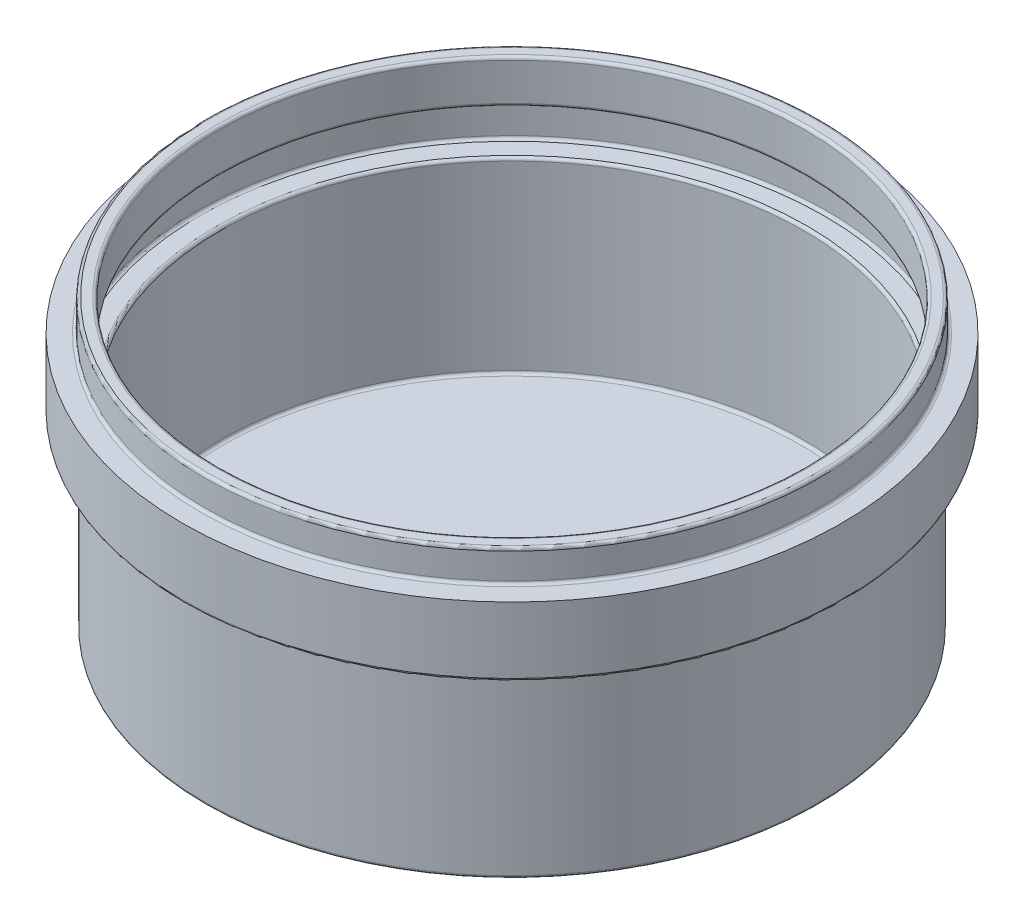
ISO-10303-21;
HEADER;
FILE_DESCRIPTION(('STEP AP214'),'2;1');
FILE_NAME('part.step','',(''),(''),'','','');
FILE_SCHEMA(('AUTOMOTIVE_DESIGN { 1 0 10303 214 1 1 1 1 }'));
ENDSEC;
DATA;
#1=APPLICATION_CONTEXT('core data for automotive mechanical design processes');
#2=APPLICATION_PROTOCOL_DEFINITION('international standard','automotive_design',2000,#1);
#3=PRODUCT_CONTEXT('',#1,'mechanical');
#4=PRODUCT('Part','Part','',(#3));
#5=PRODUCT_RELATED_PRODUCT_CATEGORY('part','',(#4));
#6=PRODUCT_DEFINITION_FORMATION('','',#4);
#7=PRODUCT_DEFINITION_CONTEXT('part definition',#1,'design');
#8=PRODUCT_DEFINITION('design','',#6,#7);
#9=PRODUCT_DEFINITION_SHAPE('','',#8);
#10=(LENGTH_UNIT() NAMED_UNIT(*) SI_UNIT(.MILLI.,.METRE.));
#11=(NAMED_UNIT(*) PLANE_ANGLE_UNIT() SI_UNIT($,.RADIAN.));
#12=(NAMED_UNIT(*) SI_UNIT($,.STERADIAN.) SOLID_ANGLE_UNIT());
#13=UNCERTAINTY_MEASURE_WITH_UNIT(LENGTH_MEASURE(1.E-05),#10,'distance_accuracy_value','');
#14=(GEOMETRIC_REPRESENTATION_CONTEXT(3) GLOBAL_UNCERTAINTY_ASSIGNED_CONTEXT((#13)) GLOBAL_UNIT_ASSIGNED_CONTEXT((#10,
#11,#12)) REPRESENTATION_CONTEXT('',''));
#15=CARTESIAN_POINT('',(0.,0.,0.));
#16=DIRECTION('',(0.,0.,1.));
#17=DIRECTION('',(1.,0.,0.));
#18=AXIS2_PLACEMENT_3D('',#15,#16,#17);
#19=CARTESIAN_POINT('',(0.,44.5,0.));
#20=DIRECTION('',(0.,-1.,0.));
#21=DIRECTION('',(0.,0.,-1.));
#22=AXIS2_PLACEMENT_3D('',#19,#20,#21);
#23=CYLINDRICAL_SURFACE('',#22,57.25);
#24=CARTESIAN_POINT('',(0.,33.,0.));
#25=DIRECTION('',(0.,1.,0.));
#26=DIRECTION('',(0.,0.,1.));
#27=AXIS2_PLACEMENT_3D('',#24,#25,#26);
#28=CIRCLE('',#27,57.25);
#29=CARTESIAN_POINT('',(0.,33.,57.25));
#30=VERTEX_POINT('',#29);
#31=EDGE_CURVE('E112',#30,#30,#28,.T.);
#32=ORIENTED_EDGE('',*,*,#31,.T.);
#33=EDGE_LOOP('',(#32));
#34=FACE_BOUND('',#33,.T.);
#35=CARTESIAN_POINT('',(0.,44.5,0.));
#36=DIRECTION('',(0.,1.,0.));
#37=DIRECTION('',(0.,0.,1.));
#38=AXIS2_PLACEMENT_3D('',#35,#36,#37);
#39=CIRCLE('',#38,57.25);
#40=CARTESIAN_POINT('',(0.,44.5,57.25));
#41=VERTEX_POINT('',#40);
#42=EDGE_CURVE('E115',#41,#41,#39,.T.);
#43=ORIENTED_EDGE('',*,*,#42,.F.);
#44=EDGE_LOOP('',(#43));
#45=FACE_BOUND('',#44,.T.);
#46=ADVANCED_FACE('F41',(#34,#45),#23,.T.);
#47=CARTESIAN_POINT('',(0.,44.5,0.));
#48=DIRECTION('',(0.,1.,0.));
#49=DIRECTION('',(0.,0.,1.));
#50=AXIS2_PLACEMENT_3D('',#47,#48,#49);
#51=PLANE('',#50);
#52=CARTESIAN_POINT('',(0.,44.5,0.));
#53=DIRECTION('',(0.,1.,0.));
#54=DIRECTION('',(0.,0.,1.));
#55=AXIS2_PLACEMENT_3D('',#52,#53,#54);
#56=CIRCLE('',#55,54.);
#57=CARTESIAN_POINT('',(0.,44.5,54.));
#58=VERTEX_POINT('',#57);
#59=EDGE_CURVE('E88',#58,#58,#56,.F.);
#60=ORIENTED_EDGE('',*,*,#59,.T.);
#61=EDGE_LOOP('',(#60));
#62=FACE_BOUND('',#61,.T.);
#63=ORIENTED_EDGE('',*,*,#42,.T.);
#64=EDGE_LOOP('',(#63));
#65=FACE_BOUND('',#64,.T.);
#66=ADVANCED_FACE('F119',(#62,#65),#51,.T.);
#67=CARTESIAN_POINT('',(0.,32.5,0.));
#68=DIRECTION('',(0.,1.,0.));
#69=DIRECTION('',(0.,0.,1.));
#70=AXIS2_PLACEMENT_3D('',#67,#68,#69);
#71=PLANE('',#70);
#72=CARTESIAN_POINT('',(0.,32.5,0.));
#73=DIRECTION('',(0.,1.,0.));
#74=DIRECTION('',(0.,0.,1.));
#75=AXIS2_PLACEMENT_3D('',#72,#73,#74);
#76=CIRCLE('',#75,56.75);
#77=CARTESIAN_POINT('',(0.,32.5,56.75));
#78=VERTEX_POINT('',#77);
#79=EDGE_CURVE('E106',#78,#78,#76,.F.);
#80=ORIENTED_EDGE('',*,*,#79,.T.);
#81=EDGE_LOOP('',(#80));
#82=FACE_BOUND('',#81,.T.);
#83=CARTESIAN_POINT('',(0.,32.5,0.));
#84=DIRECTION('',(0.,1.,0.));
#85=DIRECTION('',(0.,0.,1.));
#86=AXIS2_PLACEMENT_3D('',#83,#84,#85);
#87=CIRCLE('',#86,53.75);
#88=CARTESIAN_POINT('',(0.,32.5,53.75));
#89=VERTEX_POINT('',#88);
#90=EDGE_CURVE('E109',#89,#89,#87,.T.);
#91=ORIENTED_EDGE('',*,*,#90,.T.);
#92=EDGE_LOOP('',(#91));
#93=FACE_BOUND('',#92,.T.);
#94=ADVANCED_FACE('F127',(#82,#93),#71,.F.);
#95=CARTESIAN_POINT('',(0.,50.,0.));
#96=DIRECTION('',(0.,-1.,0.));
#97=DIRECTION('',(0.,0.,-1.));
#98=AXIS2_PLACEMENT_3D('',#95,#96,#97);
#99=CYLINDRICAL_SURFACE('',#98,53.5);
#100=CARTESIAN_POINT('',(0.,49.5,0.));
#101=DIRECTION('',(0.,1.,0.));
#102=DIRECTION('',(0.,0.,1.));
#103=AXIS2_PLACEMENT_3D('',#100,#101,#102);
#104=CIRCLE('',#103,53.5);
#105=CARTESIAN_POINT('',(0.,49.5,53.5));
#106=VERTEX_POINT('',#105);
#107=EDGE_CURVE('E91',#106,#106,#104,.F.);
#108=ORIENTED_EDGE('',*,*,#107,.T.);
#109=EDGE_LOOP('',(#108));
#110=FACE_BOUND('',#109,.T.);
#111=CARTESIAN_POINT('',(0.,45.,0.));
#112=DIRECTION('',(0.,1.,0.));
#113=DIRECTION('',(0.,0.,1.));
#114=AXIS2_PLACEMENT_3D('',#111,#112,#113);
#115=CIRCLE('',#114,53.5);
#116=CARTESIAN_POINT('',(0.,45.,53.5));
#117=VERTEX_POINT('',#116);
#118=EDGE_CURVE('E94',#117,#117,#115,.T.);
#119=ORIENTED_EDGE('',*,*,#118,.T.);
#120=EDGE_LOOP('',(#119));
#121=FACE_BOUND('',#120,.T.);
#122=ADVANCED_FACE('F214',(#110,#121),#99,.T.);
#123=CARTESIAN_POINT('',(0.,50.,0.));
#124=DIRECTION('',(0.,1.,0.));
#125=DIRECTION('',(0.,0.,1.));
#126=AXIS2_PLACEMENT_3D('',#123,#124,#125);
#127=PLANE('',#126);
#128=CARTESIAN_POINT('',(0.,50.,0.));
#129=DIRECTION('',(0.,1.,0.));
#130=DIRECTION('',(0.,0.,1.));
#131=AXIS2_PLACEMENT_3D('',#128,#129,#130);
#132=CIRCLE('',#131,51.5);
#133=CARTESIAN_POINT('',(0.,50.,51.5));
#134=VERTEX_POINT('',#133);
#135=EDGE_CURVE('E97',#134,#134,#132,.F.);
#136=ORIENTED_EDGE('',*,*,#135,.T.);
#137=EDGE_LOOP('',(#136));
#138=FACE_BOUND('',#137,.T.);
#139=CARTESIAN_POINT('',(0.,50.,0.));
#140=DIRECTION('',(0.,1.,0.));
#141=DIRECTION('',(0.,0.,1.));
#142=AXIS2_PLACEMENT_3D('',#139,#140,#141);
#143=CIRCLE('',#142,53.);
#144=CARTESIAN_POINT('',(0.,50.,53.));
#145=VERTEX_POINT('',#144);
#146=EDGE_CURVE('E100',#145,#145,#143,.T.);
#147=ORIENTED_EDGE('',*,*,#146,.T.);
#148=EDGE_LOOP('',(#147));
#149=FACE_BOUND('',#148,.T.);
#150=ADVANCED_FACE('F210',(#138,#149),#127,.T.);
#151=CARTESIAN_POINT('',(0.,42.5,0.));
#152=DIRECTION('',(0.,1.,0.));
#153=DIRECTION('',(0.,0.,1.));
#154=AXIS2_PLACEMENT_3D('',#151,#152,#153);
#155=CYLINDRICAL_SURFACE('',#154,51.);
#156=CARTESIAN_POINT('',(0.,43.,0.));
#157=DIRECTION('',(0.,1.,0.));
#158=DIRECTION('',(0.,0.,1.));
#159=AXIS2_PLACEMENT_3D('',#156,#157,#158);
#160=CIRCLE('',#159,51.);
#161=CARTESIAN_POINT('',(0.,43.,51.));
#162=VERTEX_POINT('',#161);
#163=EDGE_CURVE('E64',#162,#162,#160,.F.);
#164=ORIENTED_EDGE('',*,*,#163,.T.);
#165=EDGE_LOOP('',(#164));
#166=FACE_BOUND('',#165,.T.);
#167=CARTESIAN_POINT('',(0.,49.5,0.));
#168=DIRECTION('',(0.,1.,0.));
#169=DIRECTION('',(0.,0.,1.));
#170=AXIS2_PLACEMENT_3D('',#167,#168,#169);
#171=CIRCLE('',#170,51.);
#172=CARTESIAN_POINT('',(0.,49.5,51.));
#173=VERTEX_POINT('',#172);
#174=EDGE_CURVE('E103',#173,#173,#171,.T.);
#175=ORIENTED_EDGE('',*,*,#174,.T.);
#176=EDGE_LOOP('',(#175));
#177=FACE_BOUND('',#176,.T.);
#178=ADVANCED_FACE('F206',(#166,#177),#155,.F.);
#179=CARTESIAN_POINT('',(0.,35.,0.));
#180=DIRECTION('',(0.,1.,0.));
#181=DIRECTION('',(0.,0.,1.));
#182=AXIS2_PLACEMENT_3D('',#179,#180,#181);
#183=CYLINDRICAL_SURFACE('',#182,54.75);
#184=CARTESIAN_POINT('',(0.,42.,0.));
#185=DIRECTION('',(0.,1.,0.));
#186=DIRECTION('',(0.,0.,1.));
#187=AXIS2_PLACEMENT_3D('',#184,#185,#186);
#188=CIRCLE('',#187,54.75);
#189=CARTESIAN_POINT('',(0.,42.,54.75));
#190=VERTEX_POINT('',#189);
#191=EDGE_CURVE('E73',#190,#190,#188,.T.);
#192=ORIENTED_EDGE('',*,*,#191,.T.);
#193=EDGE_LOOP('',(#192));
#194=FACE_BOUND('',#193,.T.);
#195=CARTESIAN_POINT('',(0.,35.5,0.));
#196=DIRECTION('',(0.,1.,0.));
#197=DIRECTION('',(0.,0.,1.));
#198=AXIS2_PLACEMENT_3D('',#195,#196,#197);
#199=CIRCLE('',#198,54.75);
#200=CARTESIAN_POINT('',(0.,35.5,54.75));
#201=VERTEX_POINT('',#200);
#202=EDGE_CURVE('E76',#201,#201,#199,.F.);
#203=ORIENTED_EDGE('',*,*,#202,.T.);
#204=EDGE_LOOP('',(#203));
#205=FACE_BOUND('',#204,.T.);
#206=ADVANCED_FACE('F201',(#194,#205),#183,.F.);
#207=CARTESIAN_POINT('',(0.,35.,0.));
#208=DIRECTION('',(0.,1.,0.));
#209=DIRECTION('',(0.,0.,1.));
#210=AXIS2_PLACEMENT_3D('',#207,#208,#209);
#211=PLANE('',#210);
#212=CARTESIAN_POINT('',(0.,35.,0.));
#213=DIRECTION('',(0.,1.,0.));
#214=DIRECTION('',(0.,0.,1.));
#215=AXIS2_PLACEMENT_3D('',#212,#213,#214);
#216=CIRCLE('',#215,54.25);
#217=CARTESIAN_POINT('',(0.,35.,54.25));
#218=VERTEX_POINT('',#217);
#219=EDGE_CURVE('E56',#218,#218,#216,.T.);
#220=ORIENTED_EDGE('',*,*,#219,.T.);
#221=EDGE_LOOP('',(#220));
#222=FACE_BOUND('',#221,.T.);
#223=CARTESIAN_POINT('',(0.,35.,0.));
#224=DIRECTION('',(0.,1.,0.));
#225=DIRECTION('',(0.,0.,1.));
#226=AXIS2_PLACEMENT_3D('',#223,#224,#225);
#227=CIRCLE('',#226,51.25);
#228=CARTESIAN_POINT('',(0.,35.,51.25));
#229=VERTEX_POINT('',#228);
#230=EDGE_CURVE('E61',#229,#229,#227,.F.);
#231=ORIENTED_EDGE('',*,*,#230,.T.);
#232=EDGE_LOOP('',(#231));
#233=FACE_BOUND('',#232,.T.);
#234=ADVANCED_FACE('F195',(#222,#233),#211,.T.);
#235=CARTESIAN_POINT('',(0.,42.5,0.));
#236=DIRECTION('',(0.,1.,0.));
#237=DIRECTION('',(0.,0.,1.));
#238=AXIS2_PLACEMENT_3D('',#235,#236,#237);
#239=PLANE('',#238);
#240=CARTESIAN_POINT('',(0.,42.5,0.));
#241=DIRECTION('',(0.,1.,0.));
#242=DIRECTION('',(0.,0.,1.));
#243=AXIS2_PLACEMENT_3D('',#240,#241,#242);
#244=CIRCLE('',#243,54.25);
#245=CARTESIAN_POINT('',(0.,42.5,54.25));
#246=VERTEX_POINT('',#245);
#247=EDGE_CURVE('E67',#246,#246,#244,.F.);
#248=ORIENTED_EDGE('',*,*,#247,.T.);
#249=EDGE_LOOP('',(#248));
#250=FACE_BOUND('',#249,.T.);
#251=CARTESIAN_POINT('',(0.,42.5,0.));
#252=DIRECTION('',(0.,1.,0.));
#253=DIRECTION('',(0.,0.,1.));
#254=AXIS2_PLACEMENT_3D('',#251,#252,#253);
#255=CIRCLE('',#254,51.5);
#256=CARTESIAN_POINT('',(0.,42.5,51.5));
#257=VERTEX_POINT('',#256);
#258=EDGE_CURVE('E70',#257,#257,#255,.T.);
#259=ORIENTED_EDGE('',*,*,#258,.T.);
#260=EDGE_LOOP('',(#259));
#261=FACE_BOUND('',#260,.T.);
#262=ADVANCED_FACE('F185',(#250,#261),#239,.F.);
#263=CARTESIAN_POINT('',(0.,27.5,0.));
#264=DIRECTION('',(0.,1.,0.));
#265=DIRECTION('',(0.,0.,1.));
#266=AXIS2_PLACEMENT_3D('',#263,#264,#265);
#267=CYLINDRICAL_SURFACE('',#266,50.75);
#268=CARTESIAN_POINT('',(0.,3.,0.));
#269=DIRECTION('',(0.,1.,0.));
#270=DIRECTION('',(0.,0.,1.));
#271=AXIS2_PLACEMENT_3D('',#268,#269,#270);
#272=CIRCLE('',#271,50.75);
#273=CARTESIAN_POINT('',(0.,3.,50.75));
#274=VERTEX_POINT('',#273);
#275=EDGE_CURVE('E48',#274,#274,#272,.F.);
#276=ORIENTED_EDGE('',*,*,#275,.T.);
#277=EDGE_LOOP('',(#276));
#278=FACE_BOUND('',#277,.T.);
#279=CARTESIAN_POINT('',(0.,34.5,0.));
#280=DIRECTION('',(0.,1.,0.));
#281=DIRECTION('',(0.,0.,1.));
#282=AXIS2_PLACEMENT_3D('',#279,#280,#281);
#283=CIRCLE('',#282,50.75);
#284=CARTESIAN_POINT('',(0.,34.5,50.75));
#285=VERTEX_POINT('',#284);
#286=EDGE_CURVE('E52',#285,#285,#283,.T.);
#287=ORIENTED_EDGE('',*,*,#286,.T.);
#288=EDGE_LOOP('',(#287));
#289=FACE_BOUND('',#288,.T.);
#290=ADVANCED_FACE('F182',(#278,#289),#267,.F.);
#291=CARTESIAN_POINT('',(0.,0.,0.));
#292=DIRECTION('',(0.,1.,0.));
#293=DIRECTION('',(0.,0.,1.));
#294=AXIS2_PLACEMENT_3D('',#291,#292,#293);
#295=PLANE('',#294);
#296=CARTESIAN_POINT('',(0.,0.,0.));
#297=DIRECTION('',(0.,1.,0.));
#298=DIRECTION('',(0.,0.,1.));
#299=AXIS2_PLACEMENT_3D('',#296,#297,#298);
#300=CIRCLE('',#299,52.75);
#301=CARTESIAN_POINT('',(0.,0.,52.75));
#302=VERTEX_POINT('',#301);
#303=EDGE_CURVE('E79',#302,#302,#300,.F.);
#304=ORIENTED_EDGE('',*,*,#303,.T.);
#305=EDGE_LOOP('',(#304));
#306=FACE_BOUND('',#305,.T.);
#307=ADVANCED_FACE('F184',(#306),#295,.F.);
#308=CARTESIAN_POINT('',(0.,2.5,0.));
#309=DIRECTION('',(0.,-1.,0.));
#310=DIRECTION('',(0.,0.,-1.));
#311=AXIS2_PLACEMENT_3D('',#308,#309,#310);
#312=CYLINDRICAL_SURFACE('',#311,53.25);
#313=CARTESIAN_POINT('',(0.,32.,0.));
#314=DIRECTION('',(0.,1.,0.));
#315=DIRECTION('',(0.,0.,1.));
#316=AXIS2_PLACEMENT_3D('',#313,#314,#315);
#317=CIRCLE('',#316,53.25);
#318=CARTESIAN_POINT('',(0.,32.,53.25));
#319=VERTEX_POINT('',#318);
#320=EDGE_CURVE('E82',#319,#319,#317,.F.);
#321=ORIENTED_EDGE('',*,*,#320,.T.);
#322=EDGE_LOOP('',(#321));
#323=FACE_BOUND('',#322,.T.);
#324=CARTESIAN_POINT('',(0.,0.5,0.));
#325=DIRECTION('',(0.,1.,0.));
#326=DIRECTION('',(0.,0.,1.));
#327=AXIS2_PLACEMENT_3D('',#324,#325,#326);
#328=CIRCLE('',#327,53.25);
#329=CARTESIAN_POINT('',(0.,0.5,53.25));
#330=VERTEX_POINT('',#329);
#331=EDGE_CURVE('E85',#330,#330,#328,.T.);
#332=ORIENTED_EDGE('',*,*,#331,.T.);
#333=EDGE_LOOP('',(#332));
#334=FACE_BOUND('',#333,.T.);
#335=ADVANCED_FACE('F192',(#323,#334),#312,.T.);
#336=CARTESIAN_POINT('',(0.,2.5,0.));
#337=DIRECTION('',(0.,1.,0.));
#338=DIRECTION('',(0.,0.,1.));
#339=AXIS2_PLACEMENT_3D('',#336,#337,#338);
#340=PLANE('',#339);
#341=CARTESIAN_POINT('',(0.,2.5,0.));
#342=DIRECTION('',(0.,1.,0.));
#343=DIRECTION('',(0.,0.,1.));
#344=AXIS2_PLACEMENT_3D('',#341,#342,#343);
#345=CIRCLE('',#344,50.25);
#346=CARTESIAN_POINT('',(0.,2.5,50.25));
#347=VERTEX_POINT('',#346);
#348=EDGE_CURVE('E10',#347,#347,#345,.T.);
#349=ORIENTED_EDGE('',*,*,#348,.T.);
#350=EDGE_LOOP('',(#349));
#351=FACE_BOUND('',#350,.T.);
#352=ADVANCED_FACE('F136',(#351),#340,.T.);
#353=CARTESIAN_POINT('',(0.,33.,0.));
#354=DIRECTION('',(0.,1.,0.));
#355=DIRECTION('',(0.,0.,1.));
#356=AXIS2_PLACEMENT_3D('',#353,#354,#355);
#357=TOROIDAL_SURFACE('',#356,56.75,0.5);
#358=ORIENTED_EDGE('',*,*,#79,.F.);
#359=EDGE_LOOP('',(#358));
#360=FACE_BOUND('',#359,.T.);
#361=ORIENTED_EDGE('',*,*,#31,.F.);
#362=EDGE_LOOP('',(#361));
#363=FACE_BOUND('',#362,.T.);
#364=ADVANCED_FACE('F132',(#360,#363),#357,.T.);
#365=CARTESIAN_POINT('',(0.,49.5,0.));
#366=DIRECTION('',(0.,1.,0.));
#367=DIRECTION('',(0.,0.,1.));
#368=AXIS2_PLACEMENT_3D('',#365,#366,#367);
#369=TOROIDAL_SURFACE('',#368,51.5,0.5);
#370=ORIENTED_EDGE('',*,*,#135,.F.);
#371=EDGE_LOOP('',(#370));
#372=FACE_BOUND('',#371,.T.);
#373=ORIENTED_EDGE('',*,*,#174,.F.);
#374=EDGE_LOOP('',(#373));
#375=FACE_BOUND('',#374,.T.);
#376=ADVANCED_FACE('F135',(#372,#375),#369,.T.);
#377=CARTESIAN_POINT('',(0.,49.5,0.));
#378=DIRECTION('',(0.,1.,0.));
#379=DIRECTION('',(0.,0.,1.));
#380=AXIS2_PLACEMENT_3D('',#377,#378,#379);
#381=TOROIDAL_SURFACE('',#380,53.,0.5);
#382=ORIENTED_EDGE('',*,*,#107,.F.);
#383=EDGE_LOOP('',(#382));
#384=FACE_BOUND('',#383,.T.);
#385=ORIENTED_EDGE('',*,*,#146,.F.);
#386=EDGE_LOOP('',(#385));
#387=FACE_BOUND('',#386,.T.);
#388=ADVANCED_FACE('F140',(#384,#387),#381,.T.);
#389=CARTESIAN_POINT('',(0.,45.,0.));
#390=DIRECTION('',(0.,1.,0.));
#391=DIRECTION('',(0.,0.,1.));
#392=AXIS2_PLACEMENT_3D('',#389,#390,#391);
#393=TOROIDAL_SURFACE('',#392,54.,0.5);
#394=ORIENTED_EDGE('',*,*,#59,.F.);
#395=EDGE_LOOP('',(#394));
#396=FACE_BOUND('',#395,.T.);
#397=ORIENTED_EDGE('',*,*,#118,.F.);
#398=EDGE_LOOP('',(#397));
#399=FACE_BOUND('',#398,.T.);
#400=ADVANCED_FACE('F144',(#396,#399),#393,.F.);
#401=CARTESIAN_POINT('',(0.,32.,0.));
#402=DIRECTION('',(0.,1.,0.));
#403=DIRECTION('',(0.,0.,1.));
#404=AXIS2_PLACEMENT_3D('',#401,#402,#403);
#405=TOROIDAL_SURFACE('',#404,53.75,0.5);
#406=ORIENTED_EDGE('',*,*,#320,.F.);
#407=EDGE_LOOP('',(#406));
#408=FACE_BOUND('',#407,.T.);
#409=ORIENTED_EDGE('',*,*,#90,.F.);
#410=EDGE_LOOP('',(#409));
#411=FACE_BOUND('',#410,.T.);
#412=ADVANCED_FACE('F148',(#408,#411),#405,.F.);
#413=CARTESIAN_POINT('',(0.,0.5,0.));
#414=DIRECTION('',(0.,1.,0.));
#415=DIRECTION('',(0.,0.,1.));
#416=AXIS2_PLACEMENT_3D('',#413,#414,#415);
#417=TOROIDAL_SURFACE('',#416,52.75,0.5);
#418=ORIENTED_EDGE('',*,*,#303,.F.);
#419=EDGE_LOOP('',(#418));
#420=FACE_BOUND('',#419,.T.);
#421=ORIENTED_EDGE('',*,*,#331,.F.);
#422=EDGE_LOOP('',(#421));
#423=FACE_BOUND('',#422,.T.);
#424=ADVANCED_FACE('F152',(#420,#423),#417,.T.);
#425=CARTESIAN_POINT('',(0.,42.,0.));
#426=DIRECTION('',(0.,1.,0.));
#427=DIRECTION('',(0.,0.,1.));
#428=AXIS2_PLACEMENT_3D('',#425,#426,#427);
#429=TOROIDAL_SURFACE('',#428,54.25,0.5);
#430=ORIENTED_EDGE('',*,*,#247,.F.);
#431=EDGE_LOOP('',(#430));
#432=FACE_BOUND('',#431,.T.);
#433=ORIENTED_EDGE('',*,*,#191,.F.);
#434=EDGE_LOOP('',(#433));
#435=FACE_BOUND('',#434,.T.);
#436=ADVANCED_FACE('F156',(#432,#435),#429,.F.);
#437=CARTESIAN_POINT('',(0.,43.,0.));
#438=DIRECTION('',(0.,1.,0.));
#439=DIRECTION('',(0.,0.,1.));
#440=AXIS2_PLACEMENT_3D('',#437,#438,#439);
#441=TOROIDAL_SURFACE('',#440,51.5,0.5);
#442=ORIENTED_EDGE('',*,*,#163,.F.);
#443=EDGE_LOOP('',(#442));
#444=FACE_BOUND('',#443,.T.);
#445=ORIENTED_EDGE('',*,*,#258,.F.);
#446=EDGE_LOOP('',(#445));
#447=FACE_BOUND('',#446,.T.);
#448=ADVANCED_FACE('F160',(#444,#447),#441,.T.);
#449=CARTESIAN_POINT('',(0.,35.5,0.));
#450=DIRECTION('',(0.,1.,0.));
#451=DIRECTION('',(0.,0.,1.));
#452=AXIS2_PLACEMENT_3D('',#449,#450,#451);
#453=TOROIDAL_SURFACE('',#452,54.25,0.5);
#454=ORIENTED_EDGE('',*,*,#202,.F.);
#455=EDGE_LOOP('',(#454));
#456=FACE_BOUND('',#455,.T.);
#457=ORIENTED_EDGE('',*,*,#219,.F.);
#458=EDGE_LOOP('',(#457));
#459=FACE_BOUND('',#458,.T.);
#460=ADVANCED_FACE('F164',(#456,#459),#453,.F.);
#461=CARTESIAN_POINT('',(0.,3.,0.));
#462=DIRECTION('',(0.,1.,0.));
#463=DIRECTION('',(0.,0.,1.));
#464=AXIS2_PLACEMENT_3D('',#461,#462,#463);
#465=TOROIDAL_SURFACE('',#464,50.25,0.5);
#466=ORIENTED_EDGE('',*,*,#348,.F.);
#467=EDGE_LOOP('',(#466));
#468=FACE_BOUND('',#467,.T.);
#469=ORIENTED_EDGE('',*,*,#275,.F.);
#470=EDGE_LOOP('',(#469));
#471=FACE_BOUND('',#470,.T.);
#472=ADVANCED_FACE('F167',(#468,#471),#465,.F.);
#473=CARTESIAN_POINT('',(0.,34.5,0.));
#474=DIRECTION('',(0.,1.,0.));
#475=DIRECTION('',(0.,0.,1.));
#476=AXIS2_PLACEMENT_3D('',#473,#474,#475);
#477=TOROIDAL_SURFACE('',#476,51.25,0.5);
#478=ORIENTED_EDGE('',*,*,#230,.F.);
#479=EDGE_LOOP('',(#478));
#480=FACE_BOUND('',#479,.T.);
#481=ORIENTED_EDGE('',*,*,#286,.F.);
#482=EDGE_LOOP('',(#481));
#483=FACE_BOUND('',#482,.T.);
#484=ADVANCED_FACE('F43',(#480,#483),#477,.T.);
#485=CLOSED_SHELL('',(#46,#66,#94,#122,#150,#178,#206,#234,#262,#290,#307,#335,#352,#364,#376,
#388,#400,#412,#424,#436,#448,#460,#472,#484));
#486=MANIFOLD_SOLID_BREP('B2',#485);
#487=ADVANCED_BREP_SHAPE_REPRESENTATION('',(#18,#486),#14);
#488=SHAPE_DEFINITION_REPRESENTATION(#9,#487);
ENDSEC;
END-ISO-10303-21;
